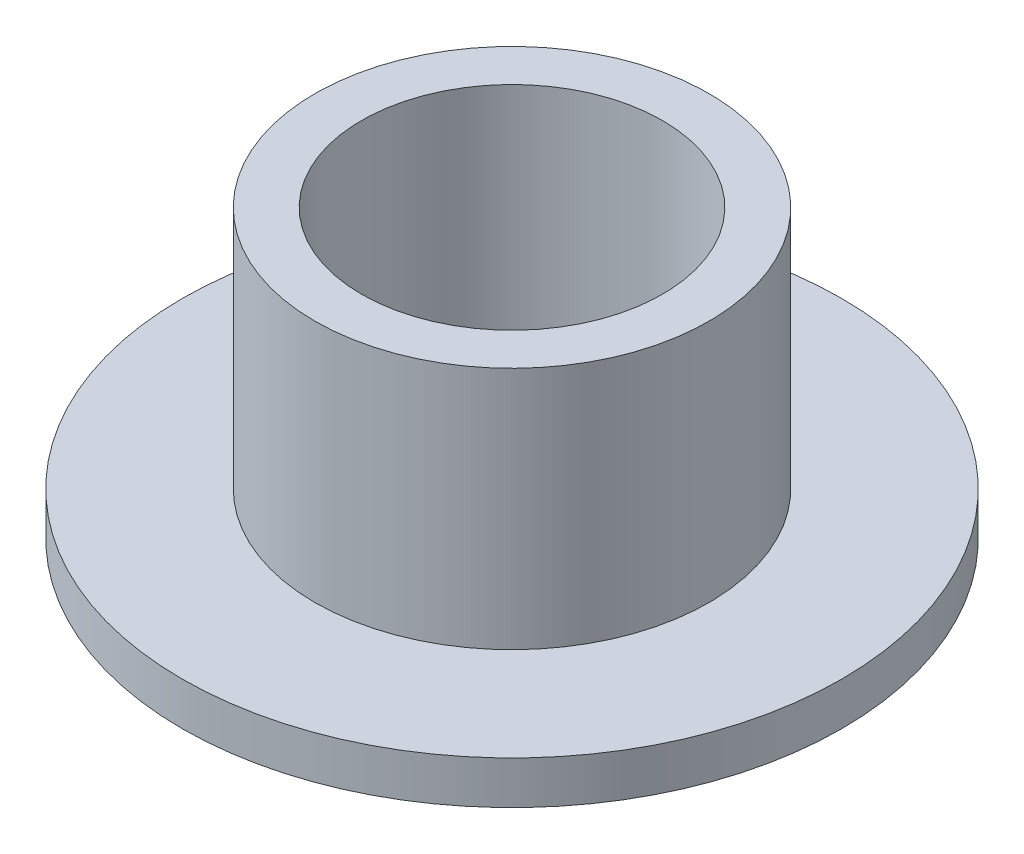
ISO-10303-21;
HEADER;
FILE_DESCRIPTION(('STEP AP214'),'2;1');
FILE_NAME('part.step','',(''),(''),'','','');
FILE_SCHEMA(('AUTOMOTIVE_DESIGN { 1 0 10303 214 1 1 1 1 }'));
ENDSEC;
DATA;
#1=APPLICATION_CONTEXT('core data for automotive mechanical design processes');
#2=APPLICATION_PROTOCOL_DEFINITION('international standard','automotive_design',2000,#1);
#3=PRODUCT_CONTEXT('',#1,'mechanical');
#4=PRODUCT('Part','Part','',(#3));
#5=PRODUCT_RELATED_PRODUCT_CATEGORY('part','',(#4));
#6=PRODUCT_DEFINITION_FORMATION('','',#4);
#7=PRODUCT_DEFINITION_CONTEXT('part definition',#1,'design');
#8=PRODUCT_DEFINITION('design','',#6,#7);
#9=PRODUCT_DEFINITION_SHAPE('','',#8);
#10=(LENGTH_UNIT() NAMED_UNIT(*) SI_UNIT(.MILLI.,.METRE.));
#11=(NAMED_UNIT(*) PLANE_ANGLE_UNIT() SI_UNIT($,.RADIAN.));
#12=(NAMED_UNIT(*) SI_UNIT($,.STERADIAN.) SOLID_ANGLE_UNIT());
#13=UNCERTAINTY_MEASURE_WITH_UNIT(LENGTH_MEASURE(1.E-05),#10,'distance_accuracy_value','');
#14=(GEOMETRIC_REPRESENTATION_CONTEXT(3) GLOBAL_UNCERTAINTY_ASSIGNED_CONTEXT((#13)) GLOBAL_UNIT_ASSIGNED_CONTEXT((#10,
#11,#12)) REPRESENTATION_CONTEXT('',''));
#15=CARTESIAN_POINT('',(0.,0.,0.));
#16=DIRECTION('',(0.,0.,1.));
#17=DIRECTION('',(1.,0.,0.));
#18=AXIS2_PLACEMENT_3D('',#15,#16,#17);
#19=CARTESIAN_POINT('',(0.,3.4,0.));
#20=DIRECTION('',(0.,-1.,0.));
#21=DIRECTION('',(0.,0.,-1.));
#22=AXIS2_PLACEMENT_3D('',#19,#20,#21);
#23=CYLINDRICAL_SURFACE('',#22,2.1);
#24=CARTESIAN_POINT('',(0.,3.4,0.));
#25=DIRECTION('',(0.,1.,0.));
#26=DIRECTION('',(0.,0.,1.));
#27=AXIS2_PLACEMENT_3D('',#24,#25,#26);
#28=CIRCLE('',#27,2.1);
#29=CARTESIAN_POINT('',(0.,3.4,2.1));
#30=VERTEX_POINT('',#29);
#31=EDGE_CURVE('E42',#30,#30,#28,.T.);
#32=ORIENTED_EDGE('',*,*,#31,.T.);
#33=EDGE_LOOP('',(#32));
#34=FACE_BOUND('',#33,.T.);
#35=CARTESIAN_POINT('',(0.,-0.6,0.));
#36=DIRECTION('',(0.,1.,0.));
#37=DIRECTION('',(0.,0.,1.));
#38=AXIS2_PLACEMENT_3D('',#35,#36,#37);
#39=CIRCLE('',#38,2.1);
#40=CARTESIAN_POINT('',(0.,-0.6,2.1));
#41=VERTEX_POINT('',#40);
#42=EDGE_CURVE('E52',#41,#41,#39,.T.);
#43=ORIENTED_EDGE('',*,*,#42,.F.);
#44=EDGE_LOOP('',(#43));
#45=FACE_BOUND('',#44,.T.);
#46=ADVANCED_FACE('F35',(#34,#45),#23,.F.);
#47=CARTESIAN_POINT('',(0.,3.4,0.));
#48=DIRECTION('',(0.,-1.,0.));
#49=DIRECTION('',(0.,0.,-1.));
#50=AXIS2_PLACEMENT_3D('',#47,#48,#49);
#51=CYLINDRICAL_SURFACE('',#50,2.75);
#52=CARTESIAN_POINT('',(0.,3.4,0.));
#53=DIRECTION('',(0.,1.,0.));
#54=DIRECTION('',(0.,0.,1.));
#55=AXIS2_PLACEMENT_3D('',#52,#53,#54);
#56=CIRCLE('',#55,2.75);
#57=CARTESIAN_POINT('',(0.,3.4,2.75));
#58=VERTEX_POINT('',#57);
#59=EDGE_CURVE('E10',#58,#58,#56,.T.);
#60=ORIENTED_EDGE('',*,*,#59,.F.);
#61=EDGE_LOOP('',(#60));
#62=FACE_BOUND('',#61,.T.);
#63=CARTESIAN_POINT('',(0.,0.,0.));
#64=DIRECTION('',(0.,1.,0.));
#65=DIRECTION('',(0.,0.,1.));
#66=AXIS2_PLACEMENT_3D('',#63,#64,#65);
#67=CIRCLE('',#66,2.75);
#68=CARTESIAN_POINT('',(0.,0.,2.75));
#69=VERTEX_POINT('',#68);
#70=EDGE_CURVE('E38',#69,#69,#67,.T.);
#71=ORIENTED_EDGE('',*,*,#70,.T.);
#72=EDGE_LOOP('',(#71));
#73=FACE_BOUND('',#72,.T.);
#74=ADVANCED_FACE('F69',(#62,#73),#51,.T.);
#75=CARTESIAN_POINT('',(0.,3.4,0.));
#76=DIRECTION('',(0.,1.,0.));
#77=DIRECTION('',(0.,0.,1.));
#78=AXIS2_PLACEMENT_3D('',#75,#76,#77);
#79=PLANE('',#78);
#80=ORIENTED_EDGE('',*,*,#31,.F.);
#81=EDGE_LOOP('',(#80));
#82=FACE_BOUND('',#81,.T.);
#83=ORIENTED_EDGE('',*,*,#59,.T.);
#84=EDGE_LOOP('',(#83));
#85=FACE_BOUND('',#84,.T.);
#86=ADVANCED_FACE('F74',(#82,#85),#79,.T.);
#87=CARTESIAN_POINT('',(0.,-0.6,0.));
#88=DIRECTION('',(0.,1.,0.));
#89=DIRECTION('',(0.,0.,1.));
#90=AXIS2_PLACEMENT_3D('',#87,#88,#89);
#91=CYLINDRICAL_SURFACE('',#90,4.6);
#92=CARTESIAN_POINT('',(0.,-0.6,0.));
#93=DIRECTION('',(0.,1.,0.));
#94=DIRECTION('',(0.,0.,1.));
#95=AXIS2_PLACEMENT_3D('',#92,#93,#94);
#96=CIRCLE('',#95,4.6);
#97=CARTESIAN_POINT('',(0.,-0.6,4.6));
#98=VERTEX_POINT('',#97);
#99=EDGE_CURVE('E51',#98,#98,#96,.T.);
#100=ORIENTED_EDGE('',*,*,#99,.T.);
#101=EDGE_LOOP('',(#100));
#102=FACE_BOUND('',#101,.T.);
#103=CARTESIAN_POINT('',(0.,0.,0.));
#104=DIRECTION('',(0.,1.,0.));
#105=DIRECTION('',(0.,0.,1.));
#106=AXIS2_PLACEMENT_3D('',#103,#104,#105);
#107=CIRCLE('',#106,4.6);
#108=CARTESIAN_POINT('',(0.,0.,4.6));
#109=VERTEX_POINT('',#108);
#110=EDGE_CURVE('E48',#109,#109,#107,.T.);
#111=ORIENTED_EDGE('',*,*,#110,.F.);
#112=EDGE_LOOP('',(#111));
#113=FACE_BOUND('',#112,.T.);
#114=ADVANCED_FACE('F58',(#102,#113),#91,.T.);
#115=CARTESIAN_POINT('',(0.,-0.6,0.));
#116=DIRECTION('',(0.,1.,0.));
#117=DIRECTION('',(0.,0.,1.));
#118=AXIS2_PLACEMENT_3D('',#115,#116,#117);
#119=PLANE('',#118);
#120=ORIENTED_EDGE('',*,*,#99,.F.);
#121=EDGE_LOOP('',(#120));
#122=FACE_BOUND('',#121,.T.);
#123=ORIENTED_EDGE('',*,*,#42,.T.);
#124=EDGE_LOOP('',(#123));
#125=FACE_BOUND('',#124,.T.);
#126=ADVANCED_FACE('F61',(#122,#125),#119,.F.);
#127=CARTESIAN_POINT('',(0.,0.,0.));
#128=DIRECTION('',(0.,1.,0.));
#129=DIRECTION('',(0.,0.,1.));
#130=AXIS2_PLACEMENT_3D('',#127,#128,#129);
#131=PLANE('',#130);
#132=ORIENTED_EDGE('',*,*,#70,.F.);
#133=EDGE_LOOP('',(#132));
#134=FACE_BOUND('',#133,.T.);
#135=ORIENTED_EDGE('',*,*,#110,.T.);
#136=EDGE_LOOP('',(#135));
#137=FACE_BOUND('',#136,.T.);
#138=ADVANCED_FACE('F64',(#134,#137),#131,.T.);
#139=CLOSED_SHELL('',(#46,#74,#86,#114,#126,#138));
#140=MANIFOLD_SOLID_BREP('B2',#139);
#141=ADVANCED_BREP_SHAPE_REPRESENTATION('',(#18,#140),#14);
#142=SHAPE_DEFINITION_REPRESENTATION(#9,#141);
ENDSEC;
END-ISO-10303-21;
